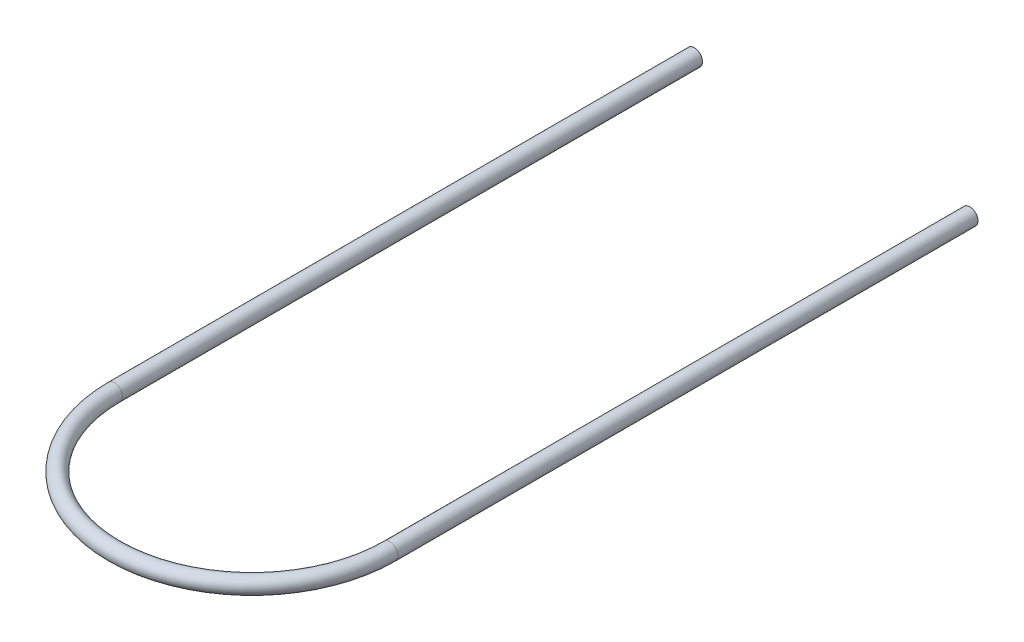
ISO-10303-21;
HEADER;
FILE_DESCRIPTION(('STEP AP214'),'2;1');
FILE_NAME('part.step','',(''),(''),'','','');
FILE_SCHEMA(('AUTOMOTIVE_DESIGN { 1 0 10303 214 1 1 1 1 }'));
ENDSEC;
DATA;
#1=APPLICATION_CONTEXT('core data for automotive mechanical design processes');
#2=APPLICATION_PROTOCOL_DEFINITION('international standard','automotive_design',2000,#1);
#3=PRODUCT_CONTEXT('',#1,'mechanical');
#4=PRODUCT('Part','Part','',(#3));
#5=PRODUCT_RELATED_PRODUCT_CATEGORY('part','',(#4));
#6=PRODUCT_DEFINITION_FORMATION('','',#4);
#7=PRODUCT_DEFINITION_CONTEXT('part definition',#1,'design');
#8=PRODUCT_DEFINITION('design','',#6,#7);
#9=PRODUCT_DEFINITION_SHAPE('','',#8);
#10=(LENGTH_UNIT() NAMED_UNIT(*) SI_UNIT(.MILLI.,.METRE.));
#11=(NAMED_UNIT(*) PLANE_ANGLE_UNIT() SI_UNIT($,.RADIAN.));
#12=(NAMED_UNIT(*) SI_UNIT($,.STERADIAN.) SOLID_ANGLE_UNIT());
#13=UNCERTAINTY_MEASURE_WITH_UNIT(LENGTH_MEASURE(1.E-05),#10,'distance_accuracy_value','');
#14=(GEOMETRIC_REPRESENTATION_CONTEXT(3) GLOBAL_UNCERTAINTY_ASSIGNED_CONTEXT((#13)) GLOBAL_UNIT_ASSIGNED_CONTEXT((#10,
#11,#12)) REPRESENTATION_CONTEXT('',''));
#15=CARTESIAN_POINT('',(0.,0.,0.));
#16=DIRECTION('',(0.,0.,1.));
#17=DIRECTION('',(1.,0.,0.));
#18=AXIS2_PLACEMENT_3D('',#15,#16,#17);
#19=CARTESIAN_POINT('',(-241.3,0.,-1016.));
#20=DIRECTION('',(0.,0.,-1.));
#21=DIRECTION('',(-1.,0.,0.));
#22=AXIS2_PLACEMENT_3D('',#19,#20,#21);
#23=PLANE('',#22);
#24=CARTESIAN_POINT('',(-241.3,0.,-1016.));
#25=DIRECTION('',(0.,0.,-1.));
#26=DIRECTION('',(-1.,0.,0.));
#27=AXIS2_PLACEMENT_3D('',#24,#25,#26);
#28=CIRCLE('',#27,14.224);
#29=CARTESIAN_POINT('',(-255.524,0.,-1016.));
#30=VERTEX_POINT('',#29);
#31=EDGE_CURVE('E59',#30,#30,#28,.T.);
#32=ORIENTED_EDGE('',*,*,#31,.T.);
#33=EDGE_LOOP('',(#32));
#34=FACE_BOUND('',#33,.T.);
#35=ADVANCED_FACE('F45',(#34),#23,.T.);
#36=CARTESIAN_POINT('',(241.3,0.,-1016.));
#37=DIRECTION('',(0.,0.,1.));
#38=DIRECTION('',(1.,0.,0.));
#39=AXIS2_PLACEMENT_3D('',#36,#37,#38);
#40=PLANE('',#39);
#41=CARTESIAN_POINT('',(241.3,0.,-1016.));
#42=DIRECTION('',(0.,0.,1.));
#43=DIRECTION('',(1.,0.,0.));
#44=AXIS2_PLACEMENT_3D('',#41,#42,#43);
#45=CIRCLE('',#44,14.224);
#46=CARTESIAN_POINT('',(255.524,0.,-1016.));
#47=VERTEX_POINT('',#46);
#48=EDGE_CURVE('E11',#47,#47,#45,.T.);
#49=ORIENTED_EDGE('',*,*,#48,.F.);
#50=EDGE_LOOP('',(#49));
#51=FACE_BOUND('',#50,.T.);
#52=ADVANCED_FACE('F69',(#51),#40,.F.);
#53=CARTESIAN_POINT('',(-241.3,0.,-1016.));
#54=DIRECTION('',(0.,0.,1.));
#55=DIRECTION('',(1.,0.,0.));
#56=AXIS2_PLACEMENT_3D('',#53,#54,#55);
#57=CYLINDRICAL_SURFACE('',#56,14.224);
#58=CARTESIAN_POINT('',(-241.3,0.,0.));
#59=DIRECTION('',(0.,0.,-1.));
#60=DIRECTION('',(-1.,0.,0.));
#61=AXIS2_PLACEMENT_3D('',#58,#59,#60);
#62=CIRCLE('',#61,14.224);
#63=CARTESIAN_POINT('',(-255.524,0.,0.));
#64=VERTEX_POINT('',#63);
#65=EDGE_CURVE('E55',#64,#64,#62,.T.);
#66=ORIENTED_EDGE('',*,*,#65,.T.);
#67=EDGE_LOOP('',(#66));
#68=FACE_BOUND('',#67,.T.);
#69=ORIENTED_EDGE('',*,*,#31,.F.);
#70=EDGE_LOOP('',(#69));
#71=FACE_BOUND('',#70,.T.);
#72=ADVANCED_FACE('F66',(#68,#71),#57,.T.);
#73=CARTESIAN_POINT('',(0.,0.,0.));
#74=DIRECTION('',(0.,1.,0.));
#75=DIRECTION('',(0.,0.,1.));
#76=AXIS2_PLACEMENT_3D('',#73,#74,#75);
#77=TOROIDAL_SURFACE('',#76,241.3,14.224);
#78=CARTESIAN_POINT('',(241.3,0.,-2.22044604925031E-13));
#79=DIRECTION('',(0.,0.,1.));
#80=DIRECTION('',(1.,0.,0.));
#81=AXIS2_PLACEMENT_3D('',#78,#79,#80);
#82=CIRCLE('',#81,14.224);
#83=CARTESIAN_POINT('',(255.524,0.,-2.35133550057454E-13));
#84=VERTEX_POINT('',#83);
#85=EDGE_CURVE('E51',#84,#84,#82,.T.);
#86=CARTESIAN_POINT('',(0.,0.,0.));
#87=DIRECTION('',(0.,1.,0.));
#88=DIRECTION('',(0.,0.,1.));
#89=AXIS2_PLACEMENT_3D('',#86,#87,#88);
#90=CIRCLE('',#89,255.524);
#91=EDGE_CURVE('',#64,#84,#90,.T.);
#92=ORIENTED_EDGE('',*,*,#65,.F.);
#93=ORIENTED_EDGE('',*,*,#85,.T.);
#94=ORIENTED_EDGE('',*,*,#91,.T.);
#95=ORIENTED_EDGE('',*,*,#91,.F.);
#96=EDGE_LOOP('',(#92,#94,#93,#95));
#97=FACE_BOUND('',#96,.T.);
#98=ADVANCED_FACE('F68',(#97),#77,.T.);
#99=CARTESIAN_POINT('',(241.3,0.,0.));
#100=DIRECTION('',(0.,0.,-1.));
#101=DIRECTION('',(-1.,0.,0.));
#102=AXIS2_PLACEMENT_3D('',#99,#100,#101);
#103=CYLINDRICAL_SURFACE('',#102,14.224);
#104=ORIENTED_EDGE('',*,*,#48,.T.);
#105=EDGE_LOOP('',(#104));
#106=FACE_BOUND('',#105,.T.);
#107=ORIENTED_EDGE('',*,*,#85,.F.);
#108=EDGE_LOOP('',(#107));
#109=FACE_BOUND('',#108,.T.);
#110=ADVANCED_FACE('F76',(#106,#109),#103,.T.);
#111=CLOSED_SHELL('',(#35,#52,#72,#98,#110));
#112=MANIFOLD_SOLID_BREP('B2',#111);
#113=ADVANCED_BREP_SHAPE_REPRESENTATION('',(#18,#112),#14);
#114=SHAPE_DEFINITION_REPRESENTATION(#9,#113);
ENDSEC;
END-ISO-10303-21;
